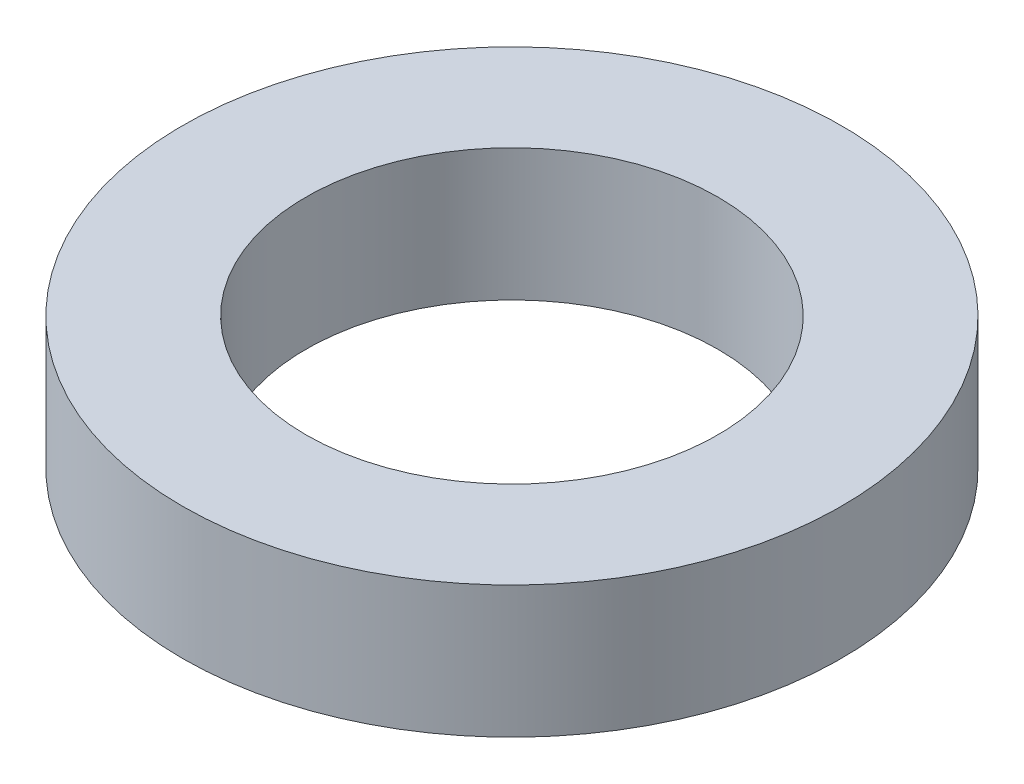
ISO-10303-21;
HEADER;
FILE_DESCRIPTION(('STEP AP214'),'2;1');
FILE_NAME('part.step','',(''),(''),'','','');
FILE_SCHEMA(('AUTOMOTIVE_DESIGN { 1 0 10303 214 1 1 1 1 }'));
ENDSEC;
DATA;
#1=APPLICATION_CONTEXT('core data for automotive mechanical design processes');
#2=APPLICATION_PROTOCOL_DEFINITION('international standard','automotive_design',2000,#1);
#3=PRODUCT_CONTEXT('',#1,'mechanical');
#4=PRODUCT('Part','Part','',(#3));
#5=PRODUCT_RELATED_PRODUCT_CATEGORY('part','',(#4));
#6=PRODUCT_DEFINITION_FORMATION('','',#4);
#7=PRODUCT_DEFINITION_CONTEXT('part definition',#1,'design');
#8=PRODUCT_DEFINITION('design','',#6,#7);
#9=PRODUCT_DEFINITION_SHAPE('','',#8);
#10=(LENGTH_UNIT() NAMED_UNIT(*) SI_UNIT(.MILLI.,.METRE.));
#11=(NAMED_UNIT(*) PLANE_ANGLE_UNIT() SI_UNIT($,.RADIAN.));
#12=(NAMED_UNIT(*) SI_UNIT($,.STERADIAN.) SOLID_ANGLE_UNIT());
#13=UNCERTAINTY_MEASURE_WITH_UNIT(LENGTH_MEASURE(1.E-05),#10,'distance_accuracy_value','');
#14=(GEOMETRIC_REPRESENTATION_CONTEXT(3) GLOBAL_UNCERTAINTY_ASSIGNED_CONTEXT((#13)) GLOBAL_UNIT_ASSIGNED_CONTEXT((#10,
#11,#12)) REPRESENTATION_CONTEXT('',''));
#15=CARTESIAN_POINT('',(0.,0.,0.));
#16=DIRECTION('',(0.,0.,1.));
#17=DIRECTION('',(1.,0.,0.));
#18=AXIS2_PLACEMENT_3D('',#15,#16,#17);
#19=CARTESIAN_POINT('',(0.,24.,0.));
#20=DIRECTION('',(0.,-1.,0.));
#21=DIRECTION('',(0.,0.,-1.));
#22=AXIS2_PLACEMENT_3D('',#19,#20,#21);
#23=CYLINDRICAL_SURFACE('',#22,60.);
#24=CARTESIAN_POINT('',(0.,24.,0.));
#25=DIRECTION('',(0.,1.,0.));
#26=DIRECTION('',(0.,0.,1.));
#27=AXIS2_PLACEMENT_3D('',#24,#25,#26);
#28=CIRCLE('',#27,60.);
#29=CARTESIAN_POINT('',(0.,24.,60.));
#30=VERTEX_POINT('',#29);
#31=EDGE_CURVE('E10',#30,#30,#28,.T.);
#32=ORIENTED_EDGE('',*,*,#31,.F.);
#33=EDGE_LOOP('',(#32));
#34=FACE_BOUND('',#33,.T.);
#35=CARTESIAN_POINT('',(0.,0.,0.));
#36=DIRECTION('',(0.,1.,0.));
#37=DIRECTION('',(0.,0.,1.));
#38=AXIS2_PLACEMENT_3D('',#35,#36,#37);
#39=CIRCLE('',#38,60.);
#40=CARTESIAN_POINT('',(0.,0.,60.));
#41=VERTEX_POINT('',#40);
#42=EDGE_CURVE('E37',#41,#41,#39,.T.);
#43=ORIENTED_EDGE('',*,*,#42,.T.);
#44=EDGE_LOOP('',(#43));
#45=FACE_BOUND('',#44,.T.);
#46=ADVANCED_FACE('F40',(#34,#45),#23,.T.);
#47=CARTESIAN_POINT('',(0.,24.,0.));
#48=DIRECTION('',(0.,1.,0.));
#49=DIRECTION('',(0.,0.,1.));
#50=AXIS2_PLACEMENT_3D('',#47,#48,#49);
#51=PLANE('',#50);
#52=CARTESIAN_POINT('',(0.,24.,0.));
#53=DIRECTION('',(0.,1.,0.));
#54=DIRECTION('',(0.,0.,1.));
#55=AXIS2_PLACEMENT_3D('',#52,#53,#54);
#56=CIRCLE('',#55,37.5);
#57=CARTESIAN_POINT('',(0.,24.,37.5));
#58=VERTEX_POINT('',#57);
#59=EDGE_CURVE('E50',#58,#58,#56,.T.);
#60=ORIENTED_EDGE('',*,*,#59,.F.);
#61=EDGE_LOOP('',(#60));
#62=FACE_BOUND('',#61,.T.);
#63=ORIENTED_EDGE('',*,*,#31,.T.);
#64=EDGE_LOOP('',(#63));
#65=FACE_BOUND('',#64,.T.);
#66=ADVANCED_FACE('F59',(#62,#65),#51,.T.);
#67=CARTESIAN_POINT('',(0.,0.,0.));
#68=DIRECTION('',(0.,1.,0.));
#69=DIRECTION('',(0.,0.,1.));
#70=AXIS2_PLACEMENT_3D('',#67,#68,#69);
#71=PLANE('',#70);
#72=CARTESIAN_POINT('',(0.,0.,0.));
#73=DIRECTION('',(0.,1.,0.));
#74=DIRECTION('',(0.,0.,1.));
#75=AXIS2_PLACEMENT_3D('',#72,#73,#74);
#76=CIRCLE('',#75,37.5);
#77=CARTESIAN_POINT('',(0.,0.,37.5));
#78=VERTEX_POINT('',#77);
#79=EDGE_CURVE('E47',#78,#78,#76,.T.);
#80=ORIENTED_EDGE('',*,*,#79,.T.);
#81=EDGE_LOOP('',(#80));
#82=FACE_BOUND('',#81,.T.);
#83=ORIENTED_EDGE('',*,*,#42,.F.);
#84=EDGE_LOOP('',(#83));
#85=FACE_BOUND('',#84,.T.);
#86=ADVANCED_FACE('F58',(#82,#85),#71,.F.);
#87=CARTESIAN_POINT('',(0.,24.,0.));
#88=DIRECTION('',(0.,-1.,0.));
#89=DIRECTION('',(0.,0.,-1.));
#90=AXIS2_PLACEMENT_3D('',#87,#88,#89);
#91=CYLINDRICAL_SURFACE('',#90,37.5);
#92=ORIENTED_EDGE('',*,*,#59,.T.);
#93=EDGE_LOOP('',(#92));
#94=FACE_BOUND('',#93,.T.);
#95=ORIENTED_EDGE('',*,*,#79,.F.);
#96=EDGE_LOOP('',(#95));
#97=FACE_BOUND('',#96,.T.);
#98=ADVANCED_FACE('F54',(#94,#97),#91,.F.);
#99=CLOSED_SHELL('',(#46,#66,#86,#98));
#100=MANIFOLD_SOLID_BREP('B2',#99);
#101=ADVANCED_BREP_SHAPE_REPRESENTATION('',(#18,#100),#14);
#102=SHAPE_DEFINITION_REPRESENTATION(#9,#101);
ENDSEC;
END-ISO-10303-21;
